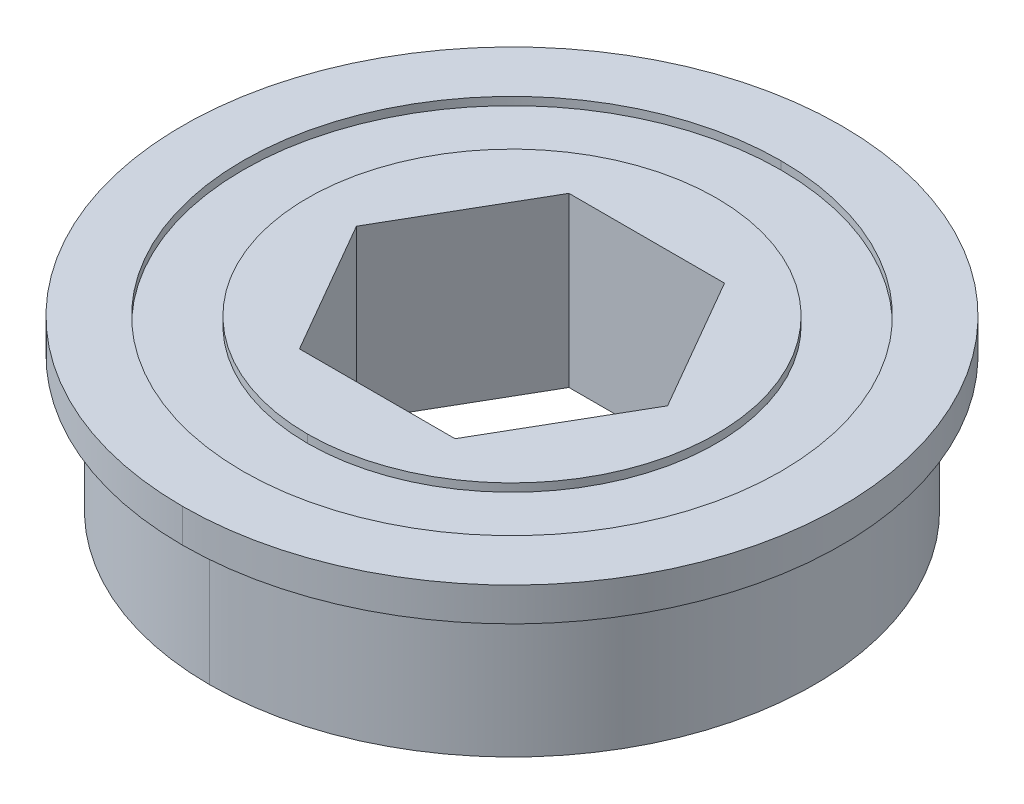
ISO-10303-21;
HEADER;
FILE_DESCRIPTION(('STEP AP214'),'2;1');
FILE_NAME('part.step','',(''),(''),'','','');
FILE_SCHEMA(('AUTOMOTIVE_DESIGN { 1 0 10303 214 1 1 1 1 }'));
ENDSEC;
DATA;
#1=APPLICATION_CONTEXT('core data for automotive mechanical design processes');
#2=APPLICATION_PROTOCOL_DEFINITION('international standard','automotive_design',2000,#1);
#3=PRODUCT_CONTEXT('',#1,'mechanical');
#4=PRODUCT('Part','Part','',(#3));
#5=PRODUCT_RELATED_PRODUCT_CATEGORY('part','',(#4));
#6=PRODUCT_DEFINITION_FORMATION('','',#4);
#7=PRODUCT_DEFINITION_CONTEXT('part definition',#1,'design');
#8=PRODUCT_DEFINITION('design','',#6,#7);
#9=PRODUCT_DEFINITION_SHAPE('','',#8);
#10=(LENGTH_UNIT() NAMED_UNIT(*) SI_UNIT(.MILLI.,.METRE.));
#11=(NAMED_UNIT(*) PLANE_ANGLE_UNIT() SI_UNIT($,.RADIAN.));
#12=(NAMED_UNIT(*) SI_UNIT($,.STERADIAN.) SOLID_ANGLE_UNIT());
#13=UNCERTAINTY_MEASURE_WITH_UNIT(LENGTH_MEASURE(1.E-05),#10,'distance_accuracy_value','');
#14=(GEOMETRIC_REPRESENTATION_CONTEXT(3) GLOBAL_UNCERTAINTY_ASSIGNED_CONTEXT((#13)) GLOBAL_UNIT_ASSIGNED_CONTEXT((#10,
#11,#12)) REPRESENTATION_CONTEXT('',''));
#15=CARTESIAN_POINT('',(0.,0.,0.));
#16=DIRECTION('',(0.,0.,1.));
#17=DIRECTION('',(1.,0.,0.));
#18=AXIS2_PLACEMENT_3D('',#15,#16,#17);
#19=CARTESIAN_POINT('',(3.67194771204602,0.,-6.36));
#20=DIRECTION('',(0.,0.,-1.));
#21=DIRECTION('',(-1.,0.,0.));
#22=AXIS2_PLACEMENT_3D('',#19,#20,#21);
#23=PLANE('',#22);
#24=DIRECTION('',(-1.,0.,0.));
#25=VECTOR('',#24,1.);
#26=CARTESIAN_POINT('',(3.67194771204602,7.9375,-6.36));
#27=LINE('',#26,#25);
#28=CARTESIAN_POINT('',(3.67194771204602,7.9375,-6.36));
#29=VERTEX_POINT('',#28);
#30=CARTESIAN_POINT('',(-3.67194771204602,7.9375,-6.36));
#31=VERTEX_POINT('',#30);
#32=EDGE_CURVE('E241',#29,#31,#27,.T.);
#33=ORIENTED_EDGE('',*,*,#32,.T.);
#34=DIRECTION('',(0.,1.,0.));
#35=VECTOR('',#34,1.);
#36=CARTESIAN_POINT('',(-3.67194771204602,0.,-6.36));
#37=LINE('',#36,#35);
#38=CARTESIAN_POINT('',(-3.67194771204602,0.,-6.36));
#39=VERTEX_POINT('',#38);
#40=EDGE_CURVE('E10',#39,#31,#37,.T.);
#41=ORIENTED_EDGE('',*,*,#40,.F.);
#42=DIRECTION('',(-1.,0.,0.));
#43=VECTOR('',#42,1.);
#44=CARTESIAN_POINT('',(3.67194771204602,0.,-6.36));
#45=LINE('',#44,#43);
#46=CARTESIAN_POINT('',(3.67194771204602,0.,-6.36));
#47=VERTEX_POINT('',#46);
#48=EDGE_CURVE('E330',#47,#39,#45,.T.);
#49=ORIENTED_EDGE('',*,*,#48,.F.);
#50=DIRECTION('',(0.,1.,0.));
#51=VECTOR('',#50,1.);
#52=CARTESIAN_POINT('',(3.67194771204602,0.,-6.36));
#53=LINE('',#52,#51);
#54=EDGE_CURVE('E237',#47,#29,#53,.T.);
#55=ORIENTED_EDGE('',*,*,#54,.T.);
#56=EDGE_LOOP('',(#33,#41,#49,#55));
#57=FACE_BOUND('',#56,.T.);
#58=ADVANCED_FACE('F16',(#57),#23,.F.);
#59=CARTESIAN_POINT('',(-3.67194771204602,0.,-6.36));
#60=DIRECTION('',(-0.866025403784439,0.,-0.5));
#61=DIRECTION('',(-0.5,0.,0.866025403784439));
#62=AXIS2_PLACEMENT_3D('',#59,#60,#61);
#63=PLANE('',#62);
#64=DIRECTION('',(-0.5,0.,0.866025403784439));
#65=VECTOR('',#64,1.);
#66=CARTESIAN_POINT('',(-3.67194771204602,7.9375,-6.36));
#67=LINE('',#66,#65);
#68=CARTESIAN_POINT('',(-7.34389542409204,7.9375,0.));
#69=VERTEX_POINT('',#68);
#70=EDGE_CURVE('E281',#31,#69,#67,.T.);
#71=ORIENTED_EDGE('',*,*,#70,.T.);
#72=DIRECTION('',(0.,1.,0.));
#73=VECTOR('',#72,1.);
#74=CARTESIAN_POINT('',(-7.34389542409204,0.,0.));
#75=LINE('',#74,#73);
#76=CARTESIAN_POINT('',(-7.34389542409204,0.,0.));
#77=VERTEX_POINT('',#76);
#78=EDGE_CURVE('E27',#77,#69,#75,.T.);
#79=ORIENTED_EDGE('',*,*,#78,.F.);
#80=DIRECTION('',(-0.5,0.,0.866025403784439));
#81=VECTOR('',#80,1.);
#82=CARTESIAN_POINT('',(-3.67194771204602,0.,-6.36));
#83=LINE('',#82,#81);
#84=EDGE_CURVE('E205',#39,#77,#83,.T.);
#85=ORIENTED_EDGE('',*,*,#84,.F.);
#86=ORIENTED_EDGE('',*,*,#40,.T.);
#87=EDGE_LOOP('',(#71,#79,#85,#86));
#88=FACE_BOUND('',#87,.T.);
#89=ADVANCED_FACE('F434',(#88),#63,.F.);
#90=CARTESIAN_POINT('',(-7.34389542409204,0.,0.));
#91=DIRECTION('',(-0.866025403784439,0.,0.5));
#92=DIRECTION('',(0.,1.,0.));
#93=AXIS2_PLACEMENT_3D('',#90,#91,#92);
#94=PLANE('',#93);
#95=DIRECTION('',(0.5,0.,0.866025403784439));
#96=VECTOR('',#95,1.);
#97=CARTESIAN_POINT('',(-7.34389542409204,7.9375,0.));
#98=LINE('',#97,#96);
#99=CARTESIAN_POINT('',(-3.67194771204601,7.9375,6.36));
#100=VERTEX_POINT('',#99);
#101=EDGE_CURVE('E261',#69,#100,#98,.T.);
#102=ORIENTED_EDGE('',*,*,#101,.T.);
#103=DIRECTION('',(0.,1.,0.));
#104=VECTOR('',#103,1.);
#105=CARTESIAN_POINT('',(-3.67194771204601,0.,6.36));
#106=LINE('',#105,#104);
#107=CARTESIAN_POINT('',(-3.67194771204601,0.,6.36));
#108=VERTEX_POINT('',#107);
#109=EDGE_CURVE('E272',#108,#100,#106,.T.);
#110=ORIENTED_EDGE('',*,*,#109,.F.);
#111=DIRECTION('',(0.5,0.,0.866025403784439));
#112=VECTOR('',#111,1.);
#113=CARTESIAN_POINT('',(-7.34389542409204,0.,0.));
#114=LINE('',#113,#112);
#115=EDGE_CURVE('E346',#77,#108,#114,.T.);
#116=ORIENTED_EDGE('',*,*,#115,.F.);
#117=ORIENTED_EDGE('',*,*,#78,.T.);
#118=EDGE_LOOP('',(#102,#110,#116,#117));
#119=FACE_BOUND('',#118,.T.);
#120=ADVANCED_FACE('F565',(#119),#94,.F.);
#121=CARTESIAN_POINT('',(-3.67194771204601,0.,6.36));
#122=DIRECTION('',(0.,0.,1.));
#123=DIRECTION('',(1.,0.,0.));
#124=AXIS2_PLACEMENT_3D('',#121,#122,#123);
#125=PLANE('',#124);
#126=DIRECTION('',(1.,0.,0.));
#127=VECTOR('',#126,1.);
#128=CARTESIAN_POINT('',(-3.67194771204601,7.9375,6.36));
#129=LINE('',#128,#127);
#130=CARTESIAN_POINT('',(3.67194771204602,7.9375,6.36));
#131=VERTEX_POINT('',#130);
#132=EDGE_CURVE('E257',#100,#131,#129,.T.);
#133=ORIENTED_EDGE('',*,*,#132,.T.);
#134=DIRECTION('',(0.,1.,0.));
#135=VECTOR('',#134,1.);
#136=CARTESIAN_POINT('',(3.67194771204602,0.,6.36));
#137=LINE('',#136,#135);
#138=CARTESIAN_POINT('',(3.67194771204602,0.,6.36));
#139=VERTEX_POINT('',#138);
#140=EDGE_CURVE('E296',#139,#131,#137,.T.);
#141=ORIENTED_EDGE('',*,*,#140,.F.);
#142=DIRECTION('',(1.,0.,0.));
#143=VECTOR('',#142,1.);
#144=CARTESIAN_POINT('',(-3.67194771204601,0.,6.36));
#145=LINE('',#144,#143);
#146=EDGE_CURVE('E350',#108,#139,#145,.T.);
#147=ORIENTED_EDGE('',*,*,#146,.F.);
#148=ORIENTED_EDGE('',*,*,#109,.T.);
#149=EDGE_LOOP('',(#133,#141,#147,#148));
#150=FACE_BOUND('',#149,.T.);
#151=ADVANCED_FACE('F559',(#150),#125,.F.);
#152=CARTESIAN_POINT('',(3.67194771204602,0.,6.36));
#153=DIRECTION('',(0.866025403784439,0.,0.5));
#154=DIRECTION('',(0.,-1.,0.));
#155=AXIS2_PLACEMENT_3D('',#152,#153,#154);
#156=PLANE('',#155);
#157=DIRECTION('',(0.5,0.,-0.866025403784439));
#158=VECTOR('',#157,1.);
#159=CARTESIAN_POINT('',(3.67194771204602,7.9375,6.36));
#160=LINE('',#159,#158);
#161=CARTESIAN_POINT('',(7.34389542409204,7.9375,0.));
#162=VERTEX_POINT('',#161);
#163=EDGE_CURVE('E262',#131,#162,#160,.T.);
#164=ORIENTED_EDGE('',*,*,#163,.T.);
#165=DIRECTION('',(0.,1.,0.));
#166=VECTOR('',#165,1.);
#167=CARTESIAN_POINT('',(7.34389542409204,0.,0.));
#168=LINE('',#167,#166);
#169=CARTESIAN_POINT('',(7.34389542409204,0.,0.));
#170=VERTEX_POINT('',#169);
#171=EDGE_CURVE('E240',#170,#162,#168,.T.);
#172=ORIENTED_EDGE('',*,*,#171,.F.);
#173=DIRECTION('',(0.5,0.,-0.866025403784439));
#174=VECTOR('',#173,1.);
#175=CARTESIAN_POINT('',(3.67194771204602,0.,6.36));
#176=LINE('',#175,#174);
#177=EDGE_CURVE('E302',#139,#170,#176,.T.);
#178=ORIENTED_EDGE('',*,*,#177,.F.);
#179=ORIENTED_EDGE('',*,*,#140,.T.);
#180=EDGE_LOOP('',(#164,#172,#178,#179));
#181=FACE_BOUND('',#180,.T.);
#182=ADVANCED_FACE('F564',(#181),#156,.F.);
#183=CARTESIAN_POINT('',(7.34389542409204,0.,0.));
#184=DIRECTION('',(0.866025403784439,0.,-0.5));
#185=DIRECTION('',(0.,-1.,0.));
#186=AXIS2_PLACEMENT_3D('',#183,#184,#185);
#187=PLANE('',#186);
#188=DIRECTION('',(-0.5,0.,-0.866025403784439));
#189=VECTOR('',#188,1.);
#190=CARTESIAN_POINT('',(7.34389542409204,7.9375,0.));
#191=LINE('',#190,#189);
#192=EDGE_CURVE('E298',#162,#29,#191,.T.);
#193=ORIENTED_EDGE('',*,*,#192,.T.);
#194=ORIENTED_EDGE('',*,*,#54,.F.);
#195=DIRECTION('',(-0.5,0.,-0.866025403784439));
#196=VECTOR('',#195,1.);
#197=CARTESIAN_POINT('',(7.34389542409204,0.,0.));
#198=LINE('',#197,#196);
#199=EDGE_CURVE('E265',#170,#47,#198,.T.);
#200=ORIENTED_EDGE('',*,*,#199,.F.);
#201=ORIENTED_EDGE('',*,*,#171,.T.);
#202=EDGE_LOOP('',(#193,#194,#200,#201));
#203=FACE_BOUND('',#202,.T.);
#204=ADVANCED_FACE('F429',(#203),#187,.F.);
#205=CARTESIAN_POINT('',(6.35,7.9375,0.));
#206=DIRECTION('',(0.,1.,0.));
#207=DIRECTION('',(1.,0.,0.));
#208=AXIS2_PLACEMENT_3D('',#205,#206,#207);
#209=PLANE('',#208);
#210=ORIENTED_EDGE('',*,*,#192,.F.);
#211=ORIENTED_EDGE('',*,*,#163,.F.);
#212=ORIENTED_EDGE('',*,*,#132,.F.);
#213=ORIENTED_EDGE('',*,*,#101,.F.);
#214=ORIENTED_EDGE('',*,*,#70,.F.);
#215=ORIENTED_EDGE('',*,*,#32,.F.);
#216=EDGE_LOOP('',(#210,#211,#212,#213,#214,#215));
#217=FACE_BOUND('',#216,.T.);
#218=CARTESIAN_POINT('',(0.,7.9375,0.));
#219=DIRECTION('',(0.,1.,0.));
#220=DIRECTION('',(0.,0.,1.));
#221=AXIS2_PLACEMENT_3D('',#218,#219,#220);
#222=CIRCLE('',#221,9.652);
#223=CARTESIAN_POINT('',(0.,7.9375,9.652));
#224=VERTEX_POINT('',#223);
#225=CARTESIAN_POINT('',(0.,7.9375,-9.652));
#226=VERTEX_POINT('',#225);
#227=EDGE_CURVE('E211',#224,#226,#222,.T.);
#228=ORIENTED_EDGE('',*,*,#227,.T.);
#229=CARTESIAN_POINT('',(0.,7.9375,0.));
#230=DIRECTION('',(0.,1.,0.));
#231=DIRECTION('',(0.,0.,1.));
#232=AXIS2_PLACEMENT_3D('',#229,#230,#231);
#233=CIRCLE('',#232,9.652);
#234=EDGE_CURVE('E266',#226,#224,#233,.T.);
#235=ORIENTED_EDGE('',*,*,#234,.T.);
#236=EDGE_LOOP('',(#228,#235));
#237=FACE_BOUND('',#236,.T.);
#238=ADVANCED_FACE('F18',(#217,#237),#209,.T.);
#239=CARTESIAN_POINT('',(9.652,0.,0.));
#240=DIRECTION('',(0.,-1.,0.));
#241=DIRECTION('',(0.,0.,-1.));
#242=AXIS2_PLACEMENT_3D('',#239,#240,#241);
#243=PLANE('',#242);
#244=ORIENTED_EDGE('',*,*,#199,.T.);
#245=ORIENTED_EDGE('',*,*,#48,.T.);
#246=ORIENTED_EDGE('',*,*,#84,.T.);
#247=ORIENTED_EDGE('',*,*,#115,.T.);
#248=ORIENTED_EDGE('',*,*,#146,.T.);
#249=ORIENTED_EDGE('',*,*,#177,.T.);
#250=EDGE_LOOP('',(#244,#245,#246,#247,#248,#249));
#251=FACE_BOUND('',#250,.T.);
#252=CARTESIAN_POINT('',(0.,0.,0.));
#253=DIRECTION('',(0.,1.,0.));
#254=DIRECTION('',(0.,0.,1.));
#255=AXIS2_PLACEMENT_3D('',#252,#253,#254);
#256=CIRCLE('',#255,9.652);
#257=CARTESIAN_POINT('',(0.,0.,9.652));
#258=VERTEX_POINT('',#257);
#259=CARTESIAN_POINT('',(0.,0.,-9.652));
#260=VERTEX_POINT('',#259);
#261=EDGE_CURVE('E365',#258,#260,#256,.T.);
#262=ORIENTED_EDGE('',*,*,#261,.F.);
#263=CARTESIAN_POINT('',(0.,0.,0.));
#264=DIRECTION('',(0.,1.,0.));
#265=DIRECTION('',(0.,0.,1.));
#266=AXIS2_PLACEMENT_3D('',#263,#264,#265);
#267=CIRCLE('',#266,9.652);
#268=EDGE_CURVE('E256',#260,#258,#267,.T.);
#269=ORIENTED_EDGE('',*,*,#268,.F.);
#270=EDGE_LOOP('',(#262,#269));
#271=FACE_BOUND('',#270,.T.);
#272=ADVANCED_FACE('F425',(#251,#271),#243,.T.);
#273=CARTESIAN_POINT('',(0.,0.,0.));
#274=DIRECTION('',(0.,1.,0.));
#275=DIRECTION('',(0.,0.,1.));
#276=AXIS2_PLACEMENT_3D('',#273,#274,#275);
#277=CYLINDRICAL_SURFACE('',#276,9.652);
#278=DIRECTION('',(0.,1.,0.));
#279=VECTOR('',#278,1.);
#280=CARTESIAN_POINT('',(0.,0.,-9.652));
#281=LINE('',#280,#279);
#282=CARTESIAN_POINT('',(0.,0.381,-9.652));
#283=VERTEX_POINT('',#282);
#284=EDGE_CURVE('E290',#260,#283,#281,.T.);
#285=ORIENTED_EDGE('',*,*,#284,.F.);
#286=ORIENTED_EDGE('',*,*,#268,.T.);
#287=DIRECTION('',(0.,1.,0.));
#288=VECTOR('',#287,1.);
#289=CARTESIAN_POINT('',(0.,0.,9.652));
#290=LINE('',#289,#288);
#291=CARTESIAN_POINT('',(0.,0.381,9.652));
#292=VERTEX_POINT('',#291);
#293=EDGE_CURVE('E192',#258,#292,#290,.T.);
#294=ORIENTED_EDGE('',*,*,#293,.T.);
#295=CARTESIAN_POINT('',(0.,0.381,0.));
#296=DIRECTION('',(0.,1.,0.));
#297=DIRECTION('',(0.,0.,1.));
#298=AXIS2_PLACEMENT_3D('',#295,#296,#297);
#299=CIRCLE('',#298,9.652);
#300=EDGE_CURVE('E236',#283,#292,#299,.T.);
#301=ORIENTED_EDGE('',*,*,#300,.F.);
#302=EDGE_LOOP('',(#285,#286,#294,#301));
#303=FACE_BOUND('',#302,.T.);
#304=ADVANCED_FACE('F627',(#303),#277,.T.);
#305=CARTESIAN_POINT('',(9.652,0.381,0.));
#306=DIRECTION('',(0.,-1.,0.));
#307=DIRECTION('',(0.,0.,-1.));
#308=AXIS2_PLACEMENT_3D('',#305,#306,#307);
#309=PLANE('',#308);
#310=CARTESIAN_POINT('',(0.,0.381,0.));
#311=DIRECTION('',(0.,1.,0.));
#312=DIRECTION('',(0.,0.,1.));
#313=AXIS2_PLACEMENT_3D('',#310,#311,#312);
#314=CIRCLE('',#313,9.652);
#315=EDGE_CURVE('E201',#292,#283,#314,.T.);
#316=ORIENTED_EDGE('',*,*,#315,.T.);
#317=ORIENTED_EDGE('',*,*,#300,.T.);
#318=EDGE_LOOP('',(#316,#317));
#319=FACE_BOUND('',#318,.T.);
#320=CARTESIAN_POINT('',(0.,0.381,0.));
#321=DIRECTION('',(0.,1.,0.));
#322=DIRECTION('',(0.,0.,1.));
#323=AXIS2_PLACEMENT_3D('',#320,#321,#322);
#324=CIRCLE('',#323,12.7);
#325=CARTESIAN_POINT('',(0.,0.381,12.7));
#326=VERTEX_POINT('',#325);
#327=CARTESIAN_POINT('',(0.,0.381,-12.7));
#328=VERTEX_POINT('',#327);
#329=EDGE_CURVE('E178',#326,#328,#324,.T.);
#330=ORIENTED_EDGE('',*,*,#329,.F.);
#331=CARTESIAN_POINT('',(0.,0.381,0.));
#332=DIRECTION('',(0.,1.,0.));
#333=DIRECTION('',(0.,0.,1.));
#334=AXIS2_PLACEMENT_3D('',#331,#332,#333);
#335=CIRCLE('',#334,12.7);
#336=EDGE_CURVE('E185',#328,#326,#335,.T.);
#337=ORIENTED_EDGE('',*,*,#336,.F.);
#338=EDGE_LOOP('',(#330,#337));
#339=FACE_BOUND('',#338,.T.);
#340=ADVANCED_FACE('F614',(#319,#339),#309,.T.);
#341=CARTESIAN_POINT('',(0.,0.,0.));
#342=DIRECTION('',(0.,1.,0.));
#343=DIRECTION('',(0.,0.,1.));
#344=AXIS2_PLACEMENT_3D('',#341,#342,#343);
#345=CYLINDRICAL_SURFACE('',#344,12.7);
#346=DIRECTION('',(0.,1.,0.));
#347=VECTOR('',#346,1.);
#348=CARTESIAN_POINT('',(0.,0.,-12.7));
#349=LINE('',#348,#347);
#350=CARTESIAN_POINT('',(0.,0.,-12.7));
#351=VERTEX_POINT('',#350);
#352=EDGE_CURVE('E173',#351,#328,#349,.T.);
#353=ORIENTED_EDGE('',*,*,#352,.F.);
#354=CARTESIAN_POINT('',(0.,0.,0.));
#355=DIRECTION('',(0.,1.,0.));
#356=DIRECTION('',(0.,0.,1.));
#357=AXIS2_PLACEMENT_3D('',#354,#355,#356);
#358=CIRCLE('',#357,12.7);
#359=CARTESIAN_POINT('',(0.,0.,12.7));
#360=VERTEX_POINT('',#359);
#361=EDGE_CURVE('E167',#360,#351,#358,.T.);
#362=ORIENTED_EDGE('',*,*,#361,.F.);
#363=DIRECTION('',(0.,1.,0.));
#364=VECTOR('',#363,1.);
#365=CARTESIAN_POINT('',(0.,0.,12.7));
#366=LINE('',#365,#364);
#367=EDGE_CURVE('E170',#360,#326,#366,.T.);
#368=ORIENTED_EDGE('',*,*,#367,.T.);
#369=ORIENTED_EDGE('',*,*,#329,.T.);
#370=EDGE_LOOP('',(#353,#362,#368,#369));
#371=FACE_BOUND('',#370,.T.);
#372=ADVANCED_FACE('F169',(#371),#345,.F.);
#373=CARTESIAN_POINT('',(14.2748,0.,0.));
#374=DIRECTION('',(0.,-1.,0.));
#375=DIRECTION('',(0.,0.,-1.));
#376=AXIS2_PLACEMENT_3D('',#373,#374,#375);
#377=PLANE('',#376);
#378=ORIENTED_EDGE('',*,*,#361,.T.);
#379=CARTESIAN_POINT('',(0.,0.,0.));
#380=DIRECTION('',(0.,1.,0.));
#381=DIRECTION('',(0.,0.,1.));
#382=AXIS2_PLACEMENT_3D('',#379,#380,#381);
#383=CIRCLE('',#382,12.7);
#384=EDGE_CURVE('E183',#351,#360,#383,.T.);
#385=ORIENTED_EDGE('',*,*,#384,.T.);
#386=EDGE_LOOP('',(#378,#385));
#387=FACE_BOUND('',#386,.T.);
#388=CARTESIAN_POINT('',(0.,0.,0.));
#389=DIRECTION('',(0.,1.,0.));
#390=DIRECTION('',(0.,0.,1.));
#391=AXIS2_PLACEMENT_3D('',#388,#389,#390);
#392=CIRCLE('',#391,14.2748);
#393=CARTESIAN_POINT('',(0.,0.,14.2748));
#394=VERTEX_POINT('',#393);
#395=CARTESIAN_POINT('',(0.,0.,-14.2748));
#396=VERTEX_POINT('',#395);
#397=EDGE_CURVE('E187',#394,#396,#392,.T.);
#398=ORIENTED_EDGE('',*,*,#397,.F.);
#399=CARTESIAN_POINT('',(0.,0.,0.));
#400=DIRECTION('',(0.,1.,0.));
#401=DIRECTION('',(0.,0.,1.));
#402=AXIS2_PLACEMENT_3D('',#399,#400,#401);
#403=CIRCLE('',#402,14.2748);
#404=EDGE_CURVE('E179',#396,#394,#403,.T.);
#405=ORIENTED_EDGE('',*,*,#404,.F.);
#406=EDGE_LOOP('',(#398,#405));
#407=FACE_BOUND('',#406,.T.);
#408=ADVANCED_FACE('F189',(#387,#407),#377,.T.);
#409=CARTESIAN_POINT('',(0.,0.,0.));
#410=DIRECTION('',(0.,1.,0.));
#411=DIRECTION('',(0.,0.,1.));
#412=AXIS2_PLACEMENT_3D('',#409,#410,#411);
#413=CYLINDRICAL_SURFACE('',#412,14.2748);
#414=DIRECTION('',(0.,1.,0.));
#415=VECTOR('',#414,1.);
#416=CARTESIAN_POINT('',(0.,0.,-14.2748));
#417=LINE('',#416,#415);
#418=CARTESIAN_POINT('',(0.,5.6,-14.2748));
#419=VERTEX_POINT('',#418);
#420=EDGE_CURVE('E213',#396,#419,#417,.T.);
#421=ORIENTED_EDGE('',*,*,#420,.F.);
#422=ORIENTED_EDGE('',*,*,#404,.T.);
#423=DIRECTION('',(0.,1.,0.));
#424=VECTOR('',#423,1.);
#425=CARTESIAN_POINT('',(0.,0.,14.2748));
#426=LINE('',#425,#424);
#427=CARTESIAN_POINT('',(0.,5.6,14.2748));
#428=VERTEX_POINT('',#427);
#429=EDGE_CURVE('E306',#394,#428,#426,.T.);
#430=ORIENTED_EDGE('',*,*,#429,.T.);
#431=CARTESIAN_POINT('',(0.,5.6,0.));
#432=DIRECTION('',(0.,1.,0.));
#433=DIRECTION('',(0.,0.,1.));
#434=AXIS2_PLACEMENT_3D('',#431,#432,#433);
#435=CIRCLE('',#434,14.2748);
#436=EDGE_CURVE('E286',#419,#428,#435,.T.);
#437=ORIENTED_EDGE('',*,*,#436,.F.);
#438=EDGE_LOOP('',(#421,#422,#430,#437));
#439=FACE_BOUND('',#438,.T.);
#440=ADVANCED_FACE('F639',(#439),#413,.T.);
#441=CARTESIAN_POINT('',(0.,5.975,0.));
#442=DIRECTION('',(0.,-1.,0.));
#443=DIRECTION('',(0.,0.,-1.));
#444=AXIS2_PLACEMENT_3D('',#441,#442,#443);
#445=CONICAL_SURFACE('',#444,14.0582936490539,0.523598775598298);
#446=DIRECTION('',(0.,-0.86602540378444,0.5));
#447=VECTOR('',#446,1.);
#448=CARTESIAN_POINT('',(0.,5.975,14.0582936490539));
#449=LINE('',#448,#447);
#450=CARTESIAN_POINT('',(0.,5.975,14.0582936490539));
#451=VERTEX_POINT('',#450);
#452=EDGE_CURVE('E345',#451,#428,#449,.T.);
#453=ORIENTED_EDGE('',*,*,#452,.F.);
#454=CARTESIAN_POINT('',(0.,5.975,0.));
#455=DIRECTION('',(0.,1.,0.));
#456=DIRECTION('',(0.,0.,1.));
#457=AXIS2_PLACEMENT_3D('',#454,#455,#456);
#458=CIRCLE('',#457,14.0582936490539);
#459=CARTESIAN_POINT('',(0.,5.975,-14.0582936490539));
#460=VERTEX_POINT('',#459);
#461=EDGE_CURVE('E222',#460,#451,#458,.T.);
#462=ORIENTED_EDGE('',*,*,#461,.F.);
#463=DIRECTION('',(0.,-0.86602540378444,-0.5));
#464=VECTOR('',#463,1.);
#465=CARTESIAN_POINT('',(0.,5.975,-14.0582936490539));
#466=LINE('',#465,#464);
#467=EDGE_CURVE('E223',#460,#419,#466,.T.);
#468=ORIENTED_EDGE('',*,*,#467,.T.);
#469=ORIENTED_EDGE('',*,*,#436,.T.);
#470=EDGE_LOOP('',(#453,#462,#468,#469));
#471=FACE_BOUND('',#470,.T.);
#472=ADVANCED_FACE('F677',(#471),#445,.T.);
#473=CARTESIAN_POINT('',(0.,6.1,0.));
#474=DIRECTION('',(0.,1.,0.));
#475=DIRECTION('',(0.,0.,1.));
#476=AXIS2_PLACEMENT_3D('',#473,#474,#475);
#477=TOROIDAL_SURFACE('',#476,14.2748,0.25);
#478=CARTESIAN_POINT('',(0.,6.1,0.));
#479=DIRECTION('',(0.,1.,0.));
#480=DIRECTION('',(0.,0.,1.));
#481=AXIS2_PLACEMENT_3D('',#478,#479,#480);
#482=CIRCLE('',#481,14.0248);
#483=CARTESIAN_POINT('',(0.,6.1,14.0248));
#484=VERTEX_POINT('',#483);
#485=CARTESIAN_POINT('',(0.,6.1,-14.0248));
#486=VERTEX_POINT('',#485);
#487=EDGE_CURVE('E320',#484,#486,#482,.T.);
#488=ORIENTED_EDGE('',*,*,#487,.F.);
#489=CARTESIAN_POINT('',(0.,6.1,14.2748));
#490=DIRECTION('',(-1.,0.,0.));
#491=DIRECTION('',(0.,0.,1.));
#492=AXIS2_PLACEMENT_3D('',#489,#490,#491);
#493=CIRCLE('',#492,0.25);
#494=EDGE_CURVE('E224',#484,#451,#493,.T.);
#495=ORIENTED_EDGE('',*,*,#494,.T.);
#496=CARTESIAN_POINT('',(0.,5.975,0.));
#497=DIRECTION('',(0.,1.,0.));
#498=DIRECTION('',(0.,0.,1.));
#499=AXIS2_PLACEMENT_3D('',#496,#497,#498);
#500=CIRCLE('',#499,14.0582936490539);
#501=EDGE_CURVE('E371',#451,#460,#500,.T.);
#502=ORIENTED_EDGE('',*,*,#501,.T.);
#503=CARTESIAN_POINT('',(0.,6.1,-14.2748));
#504=DIRECTION('',(1.,0.,0.));
#505=DIRECTION('',(0.,0.,-1.));
#506=AXIS2_PLACEMENT_3D('',#503,#504,#505);
#507=CIRCLE('',#506,0.25);
#508=EDGE_CURVE('E218',#486,#460,#507,.T.);
#509=ORIENTED_EDGE('',*,*,#508,.F.);
#510=EDGE_LOOP('',(#488,#495,#502,#509));
#511=FACE_BOUND('',#510,.T.);
#512=ADVANCED_FACE('F671',(#511),#477,.F.);
#513=CARTESIAN_POINT('',(15.5575,6.35,0.));
#514=DIRECTION('',(0.,-1.,0.));
#515=DIRECTION('',(0.,0.,-1.));
#516=AXIS2_PLACEMENT_3D('',#513,#514,#515);
#517=PLANE('',#516);
#518=CARTESIAN_POINT('',(0.,6.35,0.));
#519=DIRECTION('',(0.,1.,0.));
#520=DIRECTION('',(0.,0.,1.));
#521=AXIS2_PLACEMENT_3D('',#518,#519,#520);
#522=CIRCLE('',#521,14.2748);
#523=CARTESIAN_POINT('',(0.,6.35,14.2748));
#524=VERTEX_POINT('',#523);
#525=CARTESIAN_POINT('',(0.,6.35,-14.2748));
#526=VERTEX_POINT('',#525);
#527=EDGE_CURVE('E316',#524,#526,#522,.T.);
#528=ORIENTED_EDGE('',*,*,#527,.T.);
#529=CARTESIAN_POINT('',(0.,6.35,0.));
#530=DIRECTION('',(0.,1.,0.));
#531=DIRECTION('',(0.,0.,1.));
#532=AXIS2_PLACEMENT_3D('',#529,#530,#531);
#533=CIRCLE('',#532,14.2748);
#534=EDGE_CURVE('E315',#526,#524,#533,.T.);
#535=ORIENTED_EDGE('',*,*,#534,.T.);
#536=EDGE_LOOP('',(#528,#535));
#537=FACE_BOUND('',#536,.T.);
#538=CARTESIAN_POINT('',(0.,6.35,0.));
#539=DIRECTION('',(0.,1.,0.));
#540=DIRECTION('',(0.,0.,1.));
#541=AXIS2_PLACEMENT_3D('',#538,#539,#540);
#542=CIRCLE('',#541,15.5575);
#543=CARTESIAN_POINT('',(0.,6.35,15.5575));
#544=VERTEX_POINT('',#543);
#545=CARTESIAN_POINT('',(0.,6.35,-15.5575));
#546=VERTEX_POINT('',#545);
#547=EDGE_CURVE('E227',#544,#546,#542,.T.);
#548=ORIENTED_EDGE('',*,*,#547,.F.);
#549=CARTESIAN_POINT('',(0.,6.35,0.));
#550=DIRECTION('',(0.,1.,0.));
#551=DIRECTION('',(0.,0.,1.));
#552=AXIS2_PLACEMENT_3D('',#549,#550,#551);
#553=CIRCLE('',#552,15.5575);
#554=EDGE_CURVE('E232',#546,#544,#553,.T.);
#555=ORIENTED_EDGE('',*,*,#554,.F.);
#556=EDGE_LOOP('',(#548,#555));
#557=FACE_BOUND('',#556,.T.);
#558=ADVANCED_FACE('F676',(#537,#557),#517,.T.);
#559=CARTESIAN_POINT('',(0.,0.,0.));
#560=DIRECTION('',(0.,1.,0.));
#561=DIRECTION('',(0.,0.,1.));
#562=AXIS2_PLACEMENT_3D('',#559,#560,#561);
#563=CYLINDRICAL_SURFACE('',#562,15.5575);
#564=DIRECTION('',(0.,1.,0.));
#565=VECTOR('',#564,1.);
#566=CARTESIAN_POINT('',(0.,0.,-15.5575));
#567=LINE('',#566,#565);
#568=CARTESIAN_POINT('',(0.,7.9375,-15.5575));
#569=VERTEX_POINT('',#568);
#570=EDGE_CURVE('E248',#546,#569,#567,.T.);
#571=ORIENTED_EDGE('',*,*,#570,.F.);
#572=ORIENTED_EDGE('',*,*,#554,.T.);
#573=DIRECTION('',(0.,1.,0.));
#574=VECTOR('',#573,1.);
#575=CARTESIAN_POINT('',(0.,0.,15.5575));
#576=LINE('',#575,#574);
#577=CARTESIAN_POINT('',(0.,7.9375,15.5575));
#578=VERTEX_POINT('',#577);
#579=EDGE_CURVE('E326',#544,#578,#576,.T.);
#580=ORIENTED_EDGE('',*,*,#579,.T.);
#581=CARTESIAN_POINT('',(0.,7.9375,0.));
#582=DIRECTION('',(0.,1.,0.));
#583=DIRECTION('',(0.,0.,1.));
#584=AXIS2_PLACEMENT_3D('',#581,#582,#583);
#585=CIRCLE('',#584,15.5575);
#586=EDGE_CURVE('E228',#569,#578,#585,.T.);
#587=ORIENTED_EDGE('',*,*,#586,.F.);
#588=EDGE_LOOP('',(#571,#572,#580,#587));
#589=FACE_BOUND('',#588,.T.);
#590=ADVANCED_FACE('F550',(#589),#563,.T.);
#591=CARTESIAN_POINT('',(12.7,7.9375,0.));
#592=DIRECTION('',(0.,1.,0.));
#593=DIRECTION('',(1.,0.,0.));
#594=AXIS2_PLACEMENT_3D('',#591,#592,#593);
#595=PLANE('',#594);
#596=CARTESIAN_POINT('',(0.,7.9375,0.));
#597=DIRECTION('',(0.,1.,0.));
#598=DIRECTION('',(0.,0.,1.));
#599=AXIS2_PLACEMENT_3D('',#596,#597,#598);
#600=CIRCLE('',#599,12.7);
#601=CARTESIAN_POINT('',(0.,7.9375,12.7));
#602=VERTEX_POINT('',#601);
#603=CARTESIAN_POINT('',(0.,7.9375,-12.7));
#604=VERTEX_POINT('',#603);
#605=EDGE_CURVE('E233',#602,#604,#600,.T.);
#606=ORIENTED_EDGE('',*,*,#605,.F.);
#607=CARTESIAN_POINT('',(0.,7.9375,0.));
#608=DIRECTION('',(0.,1.,0.));
#609=DIRECTION('',(0.,0.,1.));
#610=AXIS2_PLACEMENT_3D('',#607,#608,#609);
#611=CIRCLE('',#610,12.7);
#612=EDGE_CURVE('E334',#604,#602,#611,.T.);
#613=ORIENTED_EDGE('',*,*,#612,.F.);
#614=EDGE_LOOP('',(#606,#613));
#615=FACE_BOUND('',#614,.T.);
#616=CARTESIAN_POINT('',(0.,7.9375,0.));
#617=DIRECTION('',(0.,1.,0.));
#618=DIRECTION('',(0.,0.,1.));
#619=AXIS2_PLACEMENT_3D('',#616,#617,#618);
#620=CIRCLE('',#619,15.5575);
#621=EDGE_CURVE('E252',#578,#569,#620,.T.);
#622=ORIENTED_EDGE('',*,*,#621,.T.);
#623=ORIENTED_EDGE('',*,*,#586,.T.);
#624=EDGE_LOOP('',(#622,#623));
#625=FACE_BOUND('',#624,.T.);
#626=ADVANCED_FACE('F545',(#615,#625),#595,.T.);
#627=CARTESIAN_POINT('',(0.,0.,0.));
#628=DIRECTION('',(0.,1.,0.));
#629=DIRECTION('',(0.,0.,1.));
#630=AXIS2_PLACEMENT_3D('',#627,#628,#629);
#631=CYLINDRICAL_SURFACE('',#630,12.7);
#632=DIRECTION('',(0.,1.,0.));
#633=VECTOR('',#632,1.);
#634=CARTESIAN_POINT('',(0.,0.,-12.7));
#635=LINE('',#634,#633);
#636=CARTESIAN_POINT('',(0.,7.5565,-12.7));
#637=VERTEX_POINT('',#636);
#638=EDGE_CURVE('E338',#637,#604,#635,.T.);
#639=ORIENTED_EDGE('',*,*,#638,.F.);
#640=CARTESIAN_POINT('',(0.,7.5565,0.));
#641=DIRECTION('',(0.,1.,0.));
#642=DIRECTION('',(0.,0.,1.));
#643=AXIS2_PLACEMENT_3D('',#640,#641,#642);
#644=CIRCLE('',#643,12.7);
#645=CARTESIAN_POINT('',(0.,7.5565,12.7));
#646=VERTEX_POINT('',#645);
#647=EDGE_CURVE('E269',#646,#637,#644,.T.);
#648=ORIENTED_EDGE('',*,*,#647,.F.);
#649=DIRECTION('',(0.,1.,0.));
#650=VECTOR('',#649,1.);
#651=CARTESIAN_POINT('',(0.,0.,12.7));
#652=LINE('',#651,#650);
#653=EDGE_CURVE('E247',#646,#602,#652,.T.);
#654=ORIENTED_EDGE('',*,*,#653,.T.);
#655=ORIENTED_EDGE('',*,*,#605,.T.);
#656=EDGE_LOOP('',(#639,#648,#654,#655));
#657=FACE_BOUND('',#656,.T.);
#658=ADVANCED_FACE('F533',(#657),#631,.F.);
#659=CARTESIAN_POINT('',(9.652,7.5565,0.));
#660=DIRECTION('',(0.,1.,0.));
#661=DIRECTION('',(1.,0.,0.));
#662=AXIS2_PLACEMENT_3D('',#659,#660,#661);
#663=PLANE('',#662);
#664=CARTESIAN_POINT('',(0.,7.5565,0.));
#665=DIRECTION('',(0.,1.,0.));
#666=DIRECTION('',(0.,0.,1.));
#667=AXIS2_PLACEMENT_3D('',#664,#665,#666);
#668=CIRCLE('',#667,9.652);
#669=CARTESIAN_POINT('',(0.,7.5565,9.652));
#670=VERTEX_POINT('',#669);
#671=CARTESIAN_POINT('',(0.,7.5565,-9.652));
#672=VERTEX_POINT('',#671);
#673=EDGE_CURVE('E242',#670,#672,#668,.T.);
#674=ORIENTED_EDGE('',*,*,#673,.F.);
#675=CARTESIAN_POINT('',(0.,7.5565,0.));
#676=DIRECTION('',(0.,1.,0.));
#677=DIRECTION('',(0.,0.,1.));
#678=AXIS2_PLACEMENT_3D('',#675,#676,#677);
#679=CIRCLE('',#678,9.652);
#680=EDGE_CURVE('E210',#672,#670,#679,.T.);
#681=ORIENTED_EDGE('',*,*,#680,.F.);
#682=EDGE_LOOP('',(#674,#681));
#683=FACE_BOUND('',#682,.T.);
#684=ORIENTED_EDGE('',*,*,#647,.T.);
#685=CARTESIAN_POINT('',(0.,7.5565,0.));
#686=DIRECTION('',(0.,1.,0.));
#687=DIRECTION('',(0.,0.,1.));
#688=AXIS2_PLACEMENT_3D('',#685,#686,#687);
#689=CIRCLE('',#688,12.7);
#690=EDGE_CURVE('E20',#637,#646,#689,.T.);
#691=ORIENTED_EDGE('',*,*,#690,.T.);
#692=EDGE_LOOP('',(#684,#691));
#693=FACE_BOUND('',#692,.T.);
#694=ADVANCED_FACE('F527',(#683,#693),#663,.T.);
#695=CARTESIAN_POINT('',(0.,0.,0.));
#696=DIRECTION('',(0.,1.,0.));
#697=DIRECTION('',(0.,0.,1.));
#698=AXIS2_PLACEMENT_3D('',#695,#696,#697);
#699=CYLINDRICAL_SURFACE('',#698,9.652);
#700=DIRECTION('',(0.,1.,0.));
#701=VECTOR('',#700,1.);
#702=CARTESIAN_POINT('',(0.,0.,-9.652));
#703=LINE('',#702,#701);
#704=EDGE_CURVE('E246',#672,#226,#703,.T.);
#705=ORIENTED_EDGE('',*,*,#704,.F.);
#706=ORIENTED_EDGE('',*,*,#680,.T.);
#707=DIRECTION('',(0.,1.,0.));
#708=VECTOR('',#707,1.);
#709=CARTESIAN_POINT('',(0.,0.,9.652));
#710=LINE('',#709,#708);
#711=EDGE_CURVE('E207',#670,#224,#710,.T.);
#712=ORIENTED_EDGE('',*,*,#711,.T.);
#713=ORIENTED_EDGE('',*,*,#234,.F.);
#714=EDGE_LOOP('',(#705,#706,#712,#713));
#715=FACE_BOUND('',#714,.T.);
#716=ADVANCED_FACE('F532',(#715),#699,.T.);
#717=CARTESIAN_POINT('',(0.,0.,0.));
#718=DIRECTION('',(0.,1.,0.));
#719=DIRECTION('',(0.,0.,1.));
#720=AXIS2_PLACEMENT_3D('',#717,#718,#719);
#721=CYLINDRICAL_SURFACE('',#720,9.652);
#722=ORIENTED_EDGE('',*,*,#673,.T.);
#723=ORIENTED_EDGE('',*,*,#704,.T.);
#724=ORIENTED_EDGE('',*,*,#227,.F.);
#725=ORIENTED_EDGE('',*,*,#711,.F.);
#726=EDGE_LOOP('',(#722,#723,#724,#725));
#727=FACE_BOUND('',#726,.T.);
#728=ADVANCED_FACE('F647',(#727),#721,.T.);
#729=CARTESIAN_POINT('',(0.,0.,0.));
#730=DIRECTION('',(0.,1.,0.));
#731=DIRECTION('',(0.,0.,1.));
#732=AXIS2_PLACEMENT_3D('',#729,#730,#731);
#733=CYLINDRICAL_SURFACE('',#732,12.7);
#734=ORIENTED_EDGE('',*,*,#690,.F.);
#735=ORIENTED_EDGE('',*,*,#638,.T.);
#736=ORIENTED_EDGE('',*,*,#612,.T.);
#737=ORIENTED_EDGE('',*,*,#653,.F.);
#738=EDGE_LOOP('',(#734,#735,#736,#737));
#739=FACE_BOUND('',#738,.T.);
#740=ADVANCED_FACE('F652',(#739),#733,.F.);
#741=CARTESIAN_POINT('',(0.,0.,0.));
#742=DIRECTION('',(0.,1.,0.));
#743=DIRECTION('',(0.,0.,1.));
#744=AXIS2_PLACEMENT_3D('',#741,#742,#743);
#745=CYLINDRICAL_SURFACE('',#744,15.5575);
#746=ORIENTED_EDGE('',*,*,#547,.T.);
#747=ORIENTED_EDGE('',*,*,#570,.T.);
#748=ORIENTED_EDGE('',*,*,#621,.F.);
#749=ORIENTED_EDGE('',*,*,#579,.F.);
#750=EDGE_LOOP('',(#746,#747,#748,#749));
#751=FACE_BOUND('',#750,.T.);
#752=ADVANCED_FACE('F727',(#751),#745,.T.);
#753=CARTESIAN_POINT('',(0.,6.1,0.));
#754=DIRECTION('',(0.,1.,0.));
#755=DIRECTION('',(0.,0.,1.));
#756=AXIS2_PLACEMENT_3D('',#753,#754,#755);
#757=TOROIDAL_SURFACE('',#756,14.2748,0.25);
#758=CARTESIAN_POINT('',(0.,6.1,0.));
#759=DIRECTION('',(0.,1.,0.));
#760=DIRECTION('',(0.,0.,1.));
#761=AXIS2_PLACEMENT_3D('',#758,#759,#760);
#762=CIRCLE('',#761,14.0248);
#763=EDGE_CURVE('E311',#486,#484,#762,.T.);
#764=ORIENTED_EDGE('',*,*,#763,.F.);
#765=ORIENTED_EDGE('',*,*,#508,.T.);
#766=ORIENTED_EDGE('',*,*,#461,.T.);
#767=ORIENTED_EDGE('',*,*,#494,.F.);
#768=EDGE_LOOP('',(#764,#765,#766,#767));
#769=FACE_BOUND('',#768,.T.);
#770=ADVANCED_FACE('F721',(#769),#757,.F.);
#771=CARTESIAN_POINT('',(0.,5.975,0.));
#772=DIRECTION('',(0.,-1.,0.));
#773=DIRECTION('',(0.,0.,-1.));
#774=AXIS2_PLACEMENT_3D('',#771,#772,#773);
#775=CONICAL_SURFACE('',#774,14.0582936490539,0.523598775598298);
#776=ORIENTED_EDGE('',*,*,#501,.F.);
#777=ORIENTED_EDGE('',*,*,#452,.T.);
#778=CARTESIAN_POINT('',(0.,5.6,0.));
#779=DIRECTION('',(0.,1.,0.));
#780=DIRECTION('',(0.,0.,1.));
#781=AXIS2_PLACEMENT_3D('',#778,#779,#780);
#782=CIRCLE('',#781,14.2748);
#783=EDGE_CURVE('E217',#428,#419,#782,.T.);
#784=ORIENTED_EDGE('',*,*,#783,.T.);
#785=ORIENTED_EDGE('',*,*,#467,.F.);
#786=EDGE_LOOP('',(#776,#777,#784,#785));
#787=FACE_BOUND('',#786,.T.);
#788=ADVANCED_FACE('F726',(#787),#775,.T.);
#789=CARTESIAN_POINT('',(0.,0.,0.));
#790=DIRECTION('',(0.,1.,0.));
#791=DIRECTION('',(0.,0.,1.));
#792=AXIS2_PLACEMENT_3D('',#789,#790,#791);
#793=CYLINDRICAL_SURFACE('',#792,14.2748);
#794=ORIENTED_EDGE('',*,*,#397,.T.);
#795=ORIENTED_EDGE('',*,*,#420,.T.);
#796=ORIENTED_EDGE('',*,*,#783,.F.);
#797=ORIENTED_EDGE('',*,*,#429,.F.);
#798=EDGE_LOOP('',(#794,#795,#796,#797));
#799=FACE_BOUND('',#798,.T.);
#800=ADVANCED_FACE('F580',(#799),#793,.T.);
#801=CARTESIAN_POINT('',(0.,0.,0.));
#802=DIRECTION('',(0.,1.,0.));
#803=DIRECTION('',(0.,0.,1.));
#804=AXIS2_PLACEMENT_3D('',#801,#802,#803);
#805=CYLINDRICAL_SURFACE('',#804,12.7);
#806=ORIENTED_EDGE('',*,*,#384,.F.);
#807=ORIENTED_EDGE('',*,*,#352,.T.);
#808=ORIENTED_EDGE('',*,*,#336,.T.);
#809=ORIENTED_EDGE('',*,*,#367,.F.);
#810=EDGE_LOOP('',(#806,#807,#808,#809));
#811=FACE_BOUND('',#810,.T.);
#812=ADVANCED_FACE('F182',(#811),#805,.F.);
#813=CARTESIAN_POINT('',(0.,0.,0.));
#814=DIRECTION('',(0.,1.,0.));
#815=DIRECTION('',(0.,0.,1.));
#816=AXIS2_PLACEMENT_3D('',#813,#814,#815);
#817=CYLINDRICAL_SURFACE('',#816,9.652);
#818=ORIENTED_EDGE('',*,*,#261,.T.);
#819=ORIENTED_EDGE('',*,*,#284,.T.);
#820=ORIENTED_EDGE('',*,*,#315,.F.);
#821=ORIENTED_EDGE('',*,*,#293,.F.);
#822=EDGE_LOOP('',(#818,#819,#820,#821));
#823=FACE_BOUND('',#822,.T.);
#824=ADVANCED_FACE('F579',(#823),#817,.T.);
#825=CARTESIAN_POINT('',(0.,6.1,0.));
#826=DIRECTION('',(0.,1.,0.));
#827=DIRECTION('',(0.,0.,1.));
#828=AXIS2_PLACEMENT_3D('',#825,#826,#827);
#829=TOROIDAL_SURFACE('',#828,14.2748,0.25);
#830=CARTESIAN_POINT('',(0.,6.1,-14.2748));
#831=DIRECTION('',(1.,0.,0.));
#832=DIRECTION('',(0.,0.,-1.));
#833=AXIS2_PLACEMENT_3D('',#830,#831,#832);
#834=CIRCLE('',#833,0.25);
#835=EDGE_CURVE('E324',#526,#486,#834,.T.);
#836=ORIENTED_EDGE('',*,*,#835,.T.);
#837=ORIENTED_EDGE('',*,*,#763,.T.);
#838=CARTESIAN_POINT('',(0.,6.1,14.2748));
#839=DIRECTION('',(-1.,0.,0.));
#840=DIRECTION('',(0.,0.,1.));
#841=AXIS2_PLACEMENT_3D('',#838,#839,#840);
#842=CIRCLE('',#841,0.25);
#843=EDGE_CURVE('E325',#524,#484,#842,.T.);
#844=ORIENTED_EDGE('',*,*,#843,.F.);
#845=ORIENTED_EDGE('',*,*,#534,.F.);
#846=EDGE_LOOP('',(#836,#837,#844,#845));
#847=FACE_BOUND('',#846,.T.);
#848=ADVANCED_FACE('F707',(#847),#829,.F.);
#849=CARTESIAN_POINT('',(0.,6.1,0.));
#850=DIRECTION('',(0.,1.,0.));
#851=DIRECTION('',(0.,0.,1.));
#852=AXIS2_PLACEMENT_3D('',#849,#850,#851);
#853=TOROIDAL_SURFACE('',#852,14.2748,0.25);
#854=ORIENTED_EDGE('',*,*,#843,.T.);
#855=ORIENTED_EDGE('',*,*,#487,.T.);
#856=ORIENTED_EDGE('',*,*,#835,.F.);
#857=ORIENTED_EDGE('',*,*,#527,.F.);
#858=EDGE_LOOP('',(#854,#855,#856,#857));
#859=FACE_BOUND('',#858,.T.);
#860=ADVANCED_FACE('F712',(#859),#853,.F.);
#861=CLOSED_SHELL('',(#58,#89,#120,#151,#182,#204,#238,#272,#304,#340,#372,#408,#440,#472,#512,
#558,#590,#626,#658,#694,#716,#728,#740,#752,#770,#788,#800,#812,#824,#848,#860));
#862=MANIFOLD_SOLID_BREP('B1',#861);
#863=ADVANCED_BREP_SHAPE_REPRESENTATION('',(#18,#862),#14);
#864=SHAPE_DEFINITION_REPRESENTATION(#9,#863);
ENDSEC;
END-ISO-10303-21;
